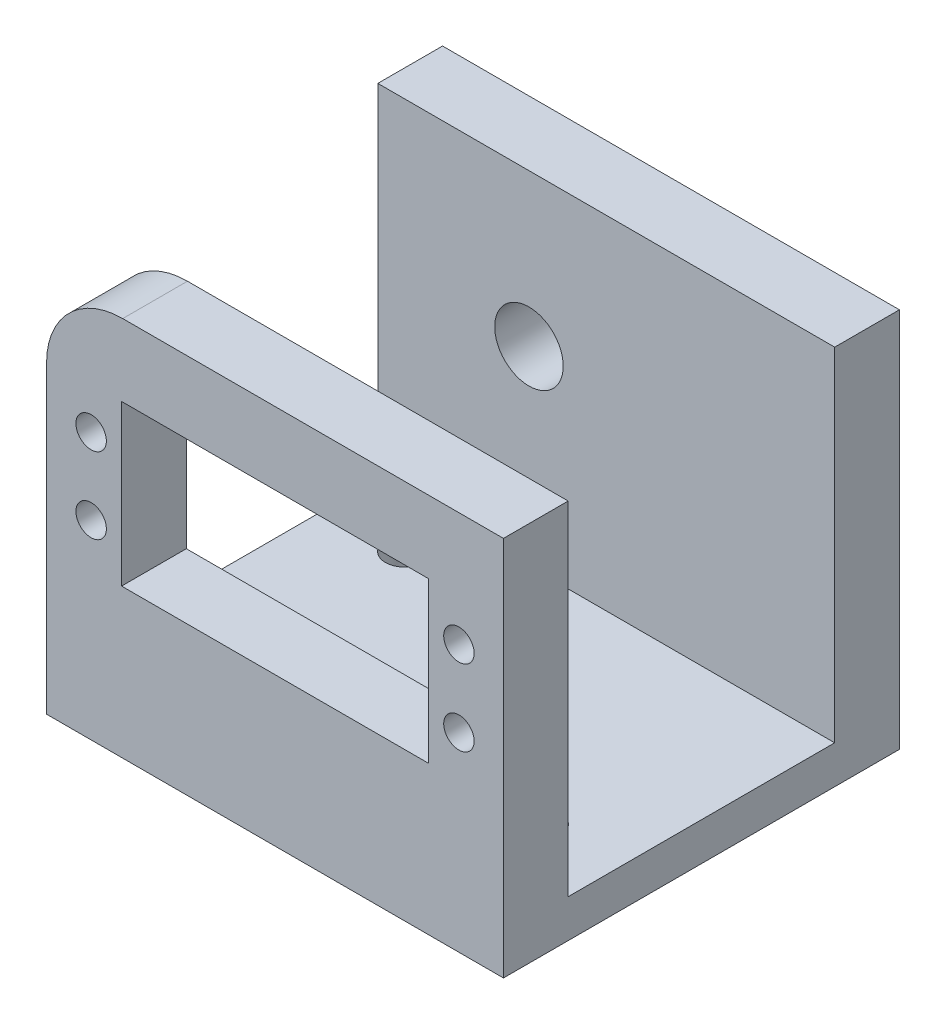
ISO-10303-21;
HEADER;
FILE_DESCRIPTION(('STEP AP214'),'2;1');
FILE_NAME('part.step','',(''),(''),'','','');
FILE_SCHEMA(('AUTOMOTIVE_DESIGN { 1 0 10303 214 1 1 1 1 }'));
ENDSEC;
DATA;
#1=APPLICATION_CONTEXT('core data for automotive mechanical design processes');
#2=APPLICATION_PROTOCOL_DEFINITION('international standard','automotive_design',2000,#1);
#3=PRODUCT_CONTEXT('',#1,'mechanical');
#4=PRODUCT('Part','Part','',(#3));
#5=PRODUCT_RELATED_PRODUCT_CATEGORY('part','',(#4));
#6=PRODUCT_DEFINITION_FORMATION('','',#4);
#7=PRODUCT_DEFINITION_CONTEXT('part definition',#1,'design');
#8=PRODUCT_DEFINITION('design','',#6,#7);
#9=PRODUCT_DEFINITION_SHAPE('','',#8);
#10=(LENGTH_UNIT() NAMED_UNIT(*) SI_UNIT(.MILLI.,.METRE.));
#11=(NAMED_UNIT(*) PLANE_ANGLE_UNIT() SI_UNIT($,.RADIAN.));
#12=(NAMED_UNIT(*) SI_UNIT($,.STERADIAN.) SOLID_ANGLE_UNIT());
#13=UNCERTAINTY_MEASURE_WITH_UNIT(LENGTH_MEASURE(1.E-05),#10,'distance_accuracy_value','');
#14=(GEOMETRIC_REPRESENTATION_CONTEXT(3) GLOBAL_UNCERTAINTY_ASSIGNED_CONTEXT((#13)) GLOBAL_UNIT_ASSIGNED_CONTEXT((#10,
#11,#12)) REPRESENTATION_CONTEXT('',''));
#15=CARTESIAN_POINT('',(0.,0.,0.));
#16=DIRECTION('',(0.,0.,1.));
#17=DIRECTION('',(1.,0.,0.));
#18=AXIS2_PLACEMENT_3D('',#15,#16,#17);
#19=CARTESIAN_POINT('',(-50.,40.,52.));
#20=DIRECTION('',(0.,0.,-1.));
#21=DIRECTION('',(-1.,0.,0.));
#22=AXIS2_PLACEMENT_3D('',#19,#20,#21);
#23=CYLINDRICAL_SURFACE('',#22,10.);
#24=DIRECTION('',(0.,0.,-1.));
#25=VECTOR('',#24,1.);
#26=CARTESIAN_POINT('',(-60.,40.,52.));
#27=LINE('',#26,#25);
#28=CARTESIAN_POINT('',(-60.,40.,52.));
#29=VERTEX_POINT('',#28);
#30=CARTESIAN_POINT('',(-60.,40.,43.5));
#31=VERTEX_POINT('',#30);
#32=EDGE_CURVE('E282',#29,#31,#27,.T.);
#33=ORIENTED_EDGE('',*,*,#32,.F.);
#34=CARTESIAN_POINT('',(-50.,40.,52.));
#35=DIRECTION('',(0.,0.,1.));
#36=DIRECTION('',(1.,0.,0.));
#37=AXIS2_PLACEMENT_3D('',#34,#35,#36);
#38=CIRCLE('',#37,10.);
#39=CARTESIAN_POINT('',(-50.,50.,52.));
#40=VERTEX_POINT('',#39);
#41=EDGE_CURVE('E11',#40,#29,#38,.T.);
#42=ORIENTED_EDGE('',*,*,#41,.F.);
#43=DIRECTION('',(0.,0.,-1.));
#44=VECTOR('',#43,1.);
#45=CARTESIAN_POINT('',(-50.,50.,52.));
#46=LINE('',#45,#44);
#47=CARTESIAN_POINT('',(-50.,50.,43.5));
#48=VERTEX_POINT('',#47);
#49=EDGE_CURVE('E47',#48,#40,#46,.F.);
#50=ORIENTED_EDGE('',*,*,#49,.F.);
#51=CARTESIAN_POINT('',(-50.,40.,43.5));
#52=DIRECTION('',(0.,0.,1.));
#53=DIRECTION('',(0.,-1.,0.));
#54=AXIS2_PLACEMENT_3D('',#51,#52,#53);
#55=CIRCLE('',#54,10.);
#56=EDGE_CURVE('E296',#31,#48,#55,.F.);
#57=ORIENTED_EDGE('',*,*,#56,.F.);
#58=EDGE_LOOP('',(#33,#42,#50,#57));
#59=FACE_BOUND('',#58,.T.);
#60=ADVANCED_FACE('F39',(#59),#23,.T.);
#61=CARTESIAN_POINT('',(0.,50.,52.));
#62=DIRECTION('',(0.,-1.,0.));
#63=DIRECTION('',(1.,0.,0.));
#64=AXIS2_PLACEMENT_3D('',#61,#62,#63);
#65=PLANE('',#64);
#66=DIRECTION('',(1.,0.,0.));
#67=VECTOR('',#66,1.);
#68=CARTESIAN_POINT('',(-60.,50.,43.5));
#69=LINE('',#68,#67);
#70=CARTESIAN_POINT('',(0.,50.,43.5));
#71=VERTEX_POINT('',#70);
#72=EDGE_CURVE('E209',#48,#71,#69,.T.);
#73=ORIENTED_EDGE('',*,*,#72,.F.);
#74=ORIENTED_EDGE('',*,*,#49,.T.);
#75=DIRECTION('',(-1.,0.,0.));
#76=VECTOR('',#75,1.);
#77=CARTESIAN_POINT('',(0.,50.,52.));
#78=LINE('',#77,#76);
#79=CARTESIAN_POINT('',(0.,50.,52.));
#80=VERTEX_POINT('',#79);
#81=EDGE_CURVE('E226',#80,#40,#78,.T.);
#82=ORIENTED_EDGE('',*,*,#81,.F.);
#83=DIRECTION('',(0.,0.,-1.));
#84=VECTOR('',#83,1.);
#85=CARTESIAN_POINT('',(0.,50.,52.));
#86=LINE('',#85,#84);
#87=EDGE_CURVE('E261',#80,#71,#86,.T.);
#88=ORIENTED_EDGE('',*,*,#87,.T.);
#89=EDGE_LOOP('',(#73,#74,#82,#88));
#90=FACE_BOUND('',#89,.T.);
#91=ADVANCED_FACE('F301',(#90),#65,.F.);
#92=CARTESIAN_POINT('',(0.,0.,52.));
#93=DIRECTION('',(-1.,0.,0.));
#94=DIRECTION('',(0.,-1.,0.));
#95=AXIS2_PLACEMENT_3D('',#92,#93,#94);
#96=PLANE('',#95);
#97=DIRECTION('',(0.,0.,-1.));
#98=VECTOR('',#97,1.);
#99=CARTESIAN_POINT('',(0.,5.,43.5));
#100=LINE('',#99,#98);
#101=CARTESIAN_POINT('',(0.,5.,43.5));
#102=VERTEX_POINT('',#101);
#103=CARTESIAN_POINT('',(0.,5.,8.49999999999999));
#104=VERTEX_POINT('',#103);
#105=EDGE_CURVE('E202',#102,#104,#100,.T.);
#106=ORIENTED_EDGE('',*,*,#105,.F.);
#107=DIRECTION('',(0.,-1.,0.));
#108=VECTOR('',#107,1.);
#109=CARTESIAN_POINT('',(0.,50.,43.5));
#110=LINE('',#109,#108);
#111=EDGE_CURVE('E198',#71,#102,#110,.T.);
#112=ORIENTED_EDGE('',*,*,#111,.F.);
#113=ORIENTED_EDGE('',*,*,#87,.F.);
#114=DIRECTION('',(0.,1.,0.));
#115=VECTOR('',#114,1.);
#116=CARTESIAN_POINT('',(0.,0.,52.));
#117=LINE('',#116,#115);
#118=CARTESIAN_POINT('',(0.,0.,52.));
#119=VERTEX_POINT('',#118);
#120=EDGE_CURVE('E222',#119,#80,#117,.T.);
#121=ORIENTED_EDGE('',*,*,#120,.F.);
#122=DIRECTION('',(0.,0.,-1.));
#123=VECTOR('',#122,1.);
#124=CARTESIAN_POINT('',(0.,0.,52.));
#125=LINE('',#124,#123);
#126=CARTESIAN_POINT('',(0.,0.,0.));
#127=VERTEX_POINT('',#126);
#128=EDGE_CURVE('E237',#119,#127,#125,.T.);
#129=ORIENTED_EDGE('',*,*,#128,.T.);
#130=DIRECTION('',(0.,1.,0.));
#131=VECTOR('',#130,1.);
#132=CARTESIAN_POINT('',(0.,0.,0.));
#133=LINE('',#132,#131);
#134=CARTESIAN_POINT('',(0.,50.,0.));
#135=VERTEX_POINT('',#134);
#136=EDGE_CURVE('E212',#127,#135,#133,.T.);
#137=ORIENTED_EDGE('',*,*,#136,.T.);
#138=CARTESIAN_POINT('',(0.,50.,8.5));
#139=VERTEX_POINT('',#138);
#140=EDGE_CURVE('E260',#139,#135,#86,.T.);
#141=ORIENTED_EDGE('',*,*,#140,.F.);
#142=DIRECTION('',(0.,1.,0.));
#143=VECTOR('',#142,1.);
#144=CARTESIAN_POINT('',(0.,50.,8.5));
#145=LINE('',#144,#143);
#146=EDGE_CURVE('E189',#104,#139,#145,.T.);
#147=ORIENTED_EDGE('',*,*,#146,.F.);
#148=EDGE_LOOP('',(#106,#112,#113,#121,#129,#137,#141,#147));
#149=FACE_BOUND('',#148,.T.);
#150=ADVANCED_FACE('F310',(#149),#96,.F.);
#151=DIRECTION('',(0.,0.,-1.));
#152=VECTOR('',#151,1.);
#153=CARTESIAN_POINT('',(-60.,50.,52.));
#154=LINE('',#153,#152);
#155=CARTESIAN_POINT('',(-60.,50.,8.5));
#156=VERTEX_POINT('',#155);
#157=CARTESIAN_POINT('',(-60.,50.,0.));
#158=VERTEX_POINT('',#157);
#159=EDGE_CURVE('E257',#156,#158,#154,.T.);
#160=ORIENTED_EDGE('',*,*,#159,.F.);
#161=DIRECTION('',(1.,0.,0.));
#162=VECTOR('',#161,1.);
#163=CARTESIAN_POINT('',(-60.,50.,8.5));
#164=LINE('',#163,#162);
#165=EDGE_CURVE('E213',#156,#139,#164,.T.);
#166=ORIENTED_EDGE('',*,*,#165,.T.);
#167=ORIENTED_EDGE('',*,*,#140,.T.);
#168=DIRECTION('',(-1.,0.,0.));
#169=VECTOR('',#168,1.);
#170=CARTESIAN_POINT('',(0.,50.,0.));
#171=LINE('',#170,#169);
#172=EDGE_CURVE('E241',#135,#158,#171,.T.);
#173=ORIENTED_EDGE('',*,*,#172,.T.);
#174=EDGE_LOOP('',(#160,#166,#167,#173));
#175=FACE_BOUND('',#174,.T.);
#176=ADVANCED_FACE('F332',(#175),#65,.F.);
#177=CARTESIAN_POINT('',(-60.,0.,52.));
#178=DIRECTION('',(1.,0.,0.));
#179=DIRECTION('',(0.,0.,-1.));
#180=AXIS2_PLACEMENT_3D('',#177,#178,#179);
#181=PLANE('',#180);
#182=DIRECTION('',(0.,-1.,0.));
#183=VECTOR('',#182,1.);
#184=CARTESIAN_POINT('',(-60.,0.,52.));
#185=LINE('',#184,#183);
#186=CARTESIAN_POINT('',(-60.,0.,52.));
#187=VERTEX_POINT('',#186);
#188=EDGE_CURVE('E231',#29,#187,#185,.T.);
#189=ORIENTED_EDGE('',*,*,#188,.F.);
#190=ORIENTED_EDGE('',*,*,#32,.T.);
#191=DIRECTION('',(0.,-1.,0.));
#192=VECTOR('',#191,1.);
#193=CARTESIAN_POINT('',(-60.,50.,43.5));
#194=LINE('',#193,#192);
#195=CARTESIAN_POINT('',(-60.,5.,43.5));
#196=VERTEX_POINT('',#195);
#197=EDGE_CURVE('E185',#31,#196,#194,.T.);
#198=ORIENTED_EDGE('',*,*,#197,.T.);
#199=DIRECTION('',(0.,0.,-1.));
#200=VECTOR('',#199,1.);
#201=CARTESIAN_POINT('',(-60.,5.,43.5));
#202=LINE('',#201,#200);
#203=CARTESIAN_POINT('',(-60.,5.,8.49999999999999));
#204=VERTEX_POINT('',#203);
#205=EDGE_CURVE('E188',#196,#204,#202,.T.);
#206=ORIENTED_EDGE('',*,*,#205,.T.);
#207=DIRECTION('',(0.,1.,0.));
#208=VECTOR('',#207,1.);
#209=CARTESIAN_POINT('',(-60.,50.,8.5));
#210=LINE('',#209,#208);
#211=EDGE_CURVE('E193',#204,#156,#210,.T.);
#212=ORIENTED_EDGE('',*,*,#211,.T.);
#213=ORIENTED_EDGE('',*,*,#159,.T.);
#214=DIRECTION('',(0.,-1.,0.));
#215=VECTOR('',#214,1.);
#216=CARTESIAN_POINT('',(-60.,0.,0.));
#217=LINE('',#216,#215);
#218=CARTESIAN_POINT('',(-60.,0.,0.));
#219=VERTEX_POINT('',#218);
#220=EDGE_CURVE('E245',#158,#219,#217,.T.);
#221=ORIENTED_EDGE('',*,*,#220,.T.);
#222=DIRECTION('',(0.,0.,-1.));
#223=VECTOR('',#222,1.);
#224=CARTESIAN_POINT('',(-60.,0.,52.));
#225=LINE('',#224,#223);
#226=EDGE_CURVE('E253',#187,#219,#225,.T.);
#227=ORIENTED_EDGE('',*,*,#226,.F.);
#228=EDGE_LOOP('',(#189,#190,#198,#206,#212,#213,#221,#227));
#229=FACE_BOUND('',#228,.T.);
#230=ADVANCED_FACE('F319',(#229),#181,.F.);
#231=CARTESIAN_POINT('',(0.,0.,52.));
#232=DIRECTION('',(0.,1.,0.));
#233=DIRECTION('',(-1.,0.,0.));
#234=AXIS2_PLACEMENT_3D('',#231,#232,#233);
#235=PLANE('',#234);
#236=CARTESIAN_POINT('',(-50.,0.,15.));
#237=DIRECTION('',(0.,1.,0.));
#238=DIRECTION('',(-1.,0.,0.));
#239=AXIS2_PLACEMENT_3D('',#236,#237,#238);
#240=CIRCLE('',#239,2.5);
#241=CARTESIAN_POINT('',(-52.5,0.,15.));
#242=VERTEX_POINT('',#241);
#243=EDGE_CURVE('E351',#242,#242,#240,.T.);
#244=ORIENTED_EDGE('',*,*,#243,.T.);
#245=EDGE_LOOP('',(#244));
#246=FACE_BOUND('',#245,.T.);
#247=CARTESIAN_POINT('',(-10.,0.,37.));
#248=DIRECTION('',(0.,1.,0.));
#249=DIRECTION('',(-1.,0.,0.));
#250=AXIS2_PLACEMENT_3D('',#247,#248,#249);
#251=CIRCLE('',#250,2.5);
#252=CARTESIAN_POINT('',(-12.5,0.,37.));
#253=VERTEX_POINT('',#252);
#254=EDGE_CURVE('E356',#253,#253,#251,.T.);
#255=ORIENTED_EDGE('',*,*,#254,.T.);
#256=EDGE_LOOP('',(#255));
#257=FACE_BOUND('',#256,.T.);
#258=DIRECTION('',(1.,0.,0.));
#259=VECTOR('',#258,1.);
#260=CARTESIAN_POINT('',(0.,0.,0.));
#261=LINE('',#260,#259);
#262=EDGE_CURVE('E227',#219,#127,#261,.T.);
#263=ORIENTED_EDGE('',*,*,#262,.T.);
#264=ORIENTED_EDGE('',*,*,#128,.F.);
#265=DIRECTION('',(1.,0.,0.));
#266=VECTOR('',#265,1.);
#267=CARTESIAN_POINT('',(0.,0.,52.));
#268=LINE('',#267,#266);
#269=EDGE_CURVE('E234',#187,#119,#268,.T.);
#270=ORIENTED_EDGE('',*,*,#269,.F.);
#271=ORIENTED_EDGE('',*,*,#226,.T.);
#272=EDGE_LOOP('',(#263,#264,#270,#271));
#273=FACE_BOUND('',#272,.T.);
#274=ADVANCED_FACE('F324',(#246,#257,#273),#235,.F.);
#275=CARTESIAN_POINT('',(0.,0.,52.));
#276=DIRECTION('',(0.,0.,1.));
#277=DIRECTION('',(1.,0.,0.));
#278=AXIS2_PLACEMENT_3D('',#275,#276,#277);
#279=PLANE('',#278);
#280=CARTESIAN_POINT('',(-5.85000000000008,34.9999999999988,52.));
#281=DIRECTION('',(0.,0.,1.));
#282=DIRECTION('',(1.,0.,0.));
#283=AXIS2_PLACEMENT_3D('',#280,#281,#282);
#284=CIRCLE('',#283,2.00000000000062);
#285=CARTESIAN_POINT('',(-3.84999999999945,34.9999999999988,52.));
#286=VERTEX_POINT('',#285);
#287=EDGE_CURVE('E172',#286,#286,#284,.T.);
#288=ORIENTED_EDGE('',*,*,#287,.F.);
#289=EDGE_LOOP('',(#288));
#290=FACE_BOUND('',#289,.T.);
#291=CARTESIAN_POINT('',(-54.1500000000001,24.9999999999976,52.));
#292=DIRECTION('',(0.,0.,1.));
#293=DIRECTION('',(1.,0.,0.));
#294=AXIS2_PLACEMENT_3D('',#291,#292,#293);
#295=CIRCLE('',#294,2.00000000000085);
#296=CARTESIAN_POINT('',(-52.1499999999992,24.9999999999976,52.));
#297=VERTEX_POINT('',#296);
#298=EDGE_CURVE('E177',#297,#297,#295,.T.);
#299=ORIENTED_EDGE('',*,*,#298,.F.);
#300=EDGE_LOOP('',(#299));
#301=FACE_BOUND('',#300,.T.);
#302=CARTESIAN_POINT('',(-5.85000000000008,24.9999999999976,52.));
#303=DIRECTION('',(0.,0.,1.));
#304=DIRECTION('',(1.,0.,0.));
#305=AXIS2_PLACEMENT_3D('',#302,#303,#304);
#306=CIRCLE('',#305,2.00000000000085);
#307=CARTESIAN_POINT('',(-3.84999999999922,24.9999999999976,52.));
#308=VERTEX_POINT('',#307);
#309=EDGE_CURVE('E167',#308,#308,#306,.T.);
#310=ORIENTED_EDGE('',*,*,#309,.F.);
#311=EDGE_LOOP('',(#310));
#312=FACE_BOUND('',#311,.T.);
#313=DIRECTION('',(0.,-1.,0.));
#314=VECTOR('',#313,1.);
#315=CARTESIAN_POINT('',(-50.1500000000001,40.5,52.));
#316=LINE('',#315,#314);
#317=CARTESIAN_POINT('',(-50.1500000000001,40.5,52.));
#318=VERTEX_POINT('',#317);
#319=CARTESIAN_POINT('',(-50.1500000000001,19.5,52.));
#320=VERTEX_POINT('',#319);
#321=EDGE_CURVE('E152',#318,#320,#316,.T.);
#322=ORIENTED_EDGE('',*,*,#321,.F.);
#323=DIRECTION('',(-1.,0.,0.));
#324=VECTOR('',#323,1.);
#325=CARTESIAN_POINT('',(-50.1500000000001,40.5,52.));
#326=LINE('',#325,#324);
#327=CARTESIAN_POINT('',(-9.85000000000008,40.5,52.));
#328=VERTEX_POINT('',#327);
#329=EDGE_CURVE('E157',#328,#318,#326,.T.);
#330=ORIENTED_EDGE('',*,*,#329,.F.);
#331=DIRECTION('',(0.,1.,0.));
#332=VECTOR('',#331,1.);
#333=CARTESIAN_POINT('',(-9.85000000000008,40.5,52.));
#334=LINE('',#333,#332);
#335=CARTESIAN_POINT('',(-9.85000000000008,19.5,52.));
#336=VERTEX_POINT('',#335);
#337=EDGE_CURVE('E134',#336,#328,#334,.T.);
#338=ORIENTED_EDGE('',*,*,#337,.F.);
#339=DIRECTION('',(1.,0.,0.));
#340=VECTOR('',#339,1.);
#341=CARTESIAN_POINT('',(-50.1500000000001,19.5,52.));
#342=LINE('',#341,#340);
#343=EDGE_CURVE('E146',#320,#336,#342,.T.);
#344=ORIENTED_EDGE('',*,*,#343,.F.);
#345=EDGE_LOOP('',(#322,#330,#338,#344));
#346=FACE_BOUND('',#345,.T.);
#347=CARTESIAN_POINT('',(-54.1500000000001,34.9999999999988,52.));
#348=DIRECTION('',(0.,0.,1.));
#349=DIRECTION('',(1.,0.,0.));
#350=AXIS2_PLACEMENT_3D('',#347,#348,#349);
#351=CIRCLE('',#350,2.00000000000001);
#352=CARTESIAN_POINT('',(-52.15,34.9999999999988,52.));
#353=VERTEX_POINT('',#352);
#354=EDGE_CURVE('E176',#353,#353,#351,.T.);
#355=ORIENTED_EDGE('',*,*,#354,.F.);
#356=EDGE_LOOP('',(#355));
#357=FACE_BOUND('',#356,.T.);
#358=ORIENTED_EDGE('',*,*,#81,.T.);
#359=ORIENTED_EDGE('',*,*,#41,.T.);
#360=ORIENTED_EDGE('',*,*,#188,.T.);
#361=ORIENTED_EDGE('',*,*,#269,.T.);
#362=ORIENTED_EDGE('',*,*,#120,.T.);
#363=EDGE_LOOP('',(#358,#359,#360,#361,#362));
#364=FACE_BOUND('',#363,.T.);
#365=ADVANCED_FACE('F154',(#290,#301,#312,#346,#357,#364),#279,.T.);
#366=CARTESIAN_POINT('',(0.,0.,0.));
#367=DIRECTION('',(0.,0.,1.));
#368=DIRECTION('',(1.,0.,0.));
#369=AXIS2_PLACEMENT_3D('',#366,#367,#368);
#370=PLANE('',#369);
#371=CARTESIAN_POINT('',(-40.15,30.,0.));
#372=DIRECTION('',(0.,0.,1.));
#373=DIRECTION('',(1.,0.,0.));
#374=AXIS2_PLACEMENT_3D('',#371,#372,#373);
#375=CIRCLE('',#374,4.5);
#376=CARTESIAN_POINT('',(-35.65,30.,0.));
#377=VERTEX_POINT('',#376);
#378=EDGE_CURVE('E340',#377,#377,#375,.T.);
#379=ORIENTED_EDGE('',*,*,#378,.T.);
#380=EDGE_LOOP('',(#379));
#381=FACE_BOUND('',#380,.T.);
#382=ORIENTED_EDGE('',*,*,#136,.F.);
#383=ORIENTED_EDGE('',*,*,#262,.F.);
#384=ORIENTED_EDGE('',*,*,#220,.F.);
#385=ORIENTED_EDGE('',*,*,#172,.F.);
#386=EDGE_LOOP('',(#382,#383,#384,#385));
#387=FACE_BOUND('',#386,.T.);
#388=ADVANCED_FACE('F329',(#381,#387),#370,.F.);
#389=CARTESIAN_POINT('',(-60.,50.,43.5));
#390=DIRECTION('',(0.,0.,1.));
#391=DIRECTION('',(0.,-1.,0.));
#392=AXIS2_PLACEMENT_3D('',#389,#390,#391);
#393=PLANE('',#392);
#394=CARTESIAN_POINT('',(-5.85000000000008,34.9999999999988,43.5));
#395=DIRECTION('',(0.,0.,1.));
#396=DIRECTION('',(0.,-1.,0.));
#397=AXIS2_PLACEMENT_3D('',#394,#395,#396);
#398=CIRCLE('',#397,2.00000000000062);
#399=CARTESIAN_POINT('',(-5.85000000000008,32.9999999999982,43.5));
#400=VERTEX_POINT('',#399);
#401=EDGE_CURVE('E203',#400,#400,#398,.T.);
#402=ORIENTED_EDGE('',*,*,#401,.T.);
#403=EDGE_LOOP('',(#402));
#404=FACE_BOUND('',#403,.T.);
#405=CARTESIAN_POINT('',(-54.1500000000001,24.9999999999976,43.5));
#406=DIRECTION('',(0.,0.,1.));
#407=DIRECTION('',(0.,-1.,0.));
#408=AXIS2_PLACEMENT_3D('',#405,#406,#407);
#409=CIRCLE('',#408,2.00000000000085);
#410=CARTESIAN_POINT('',(-54.1500000000001,22.9999999999968,43.5));
#411=VERTEX_POINT('',#410);
#412=EDGE_CURVE('E286',#411,#411,#409,.T.);
#413=ORIENTED_EDGE('',*,*,#412,.T.);
#414=EDGE_LOOP('',(#413));
#415=FACE_BOUND('',#414,.T.);
#416=CARTESIAN_POINT('',(-5.85000000000008,24.9999999999976,43.5));
#417=DIRECTION('',(0.,0.,1.));
#418=DIRECTION('',(0.,-1.,0.));
#419=AXIS2_PLACEMENT_3D('',#416,#417,#418);
#420=CIRCLE('',#419,2.00000000000085);
#421=CARTESIAN_POINT('',(-5.85000000000008,22.9999999999968,43.5));
#422=VERTEX_POINT('',#421);
#423=EDGE_CURVE('E269',#422,#422,#420,.T.);
#424=ORIENTED_EDGE('',*,*,#423,.T.);
#425=EDGE_LOOP('',(#424));
#426=FACE_BOUND('',#425,.T.);
#427=DIRECTION('',(-1.,0.,0.));
#428=VECTOR('',#427,1.);
#429=CARTESIAN_POINT('',(-60.,40.5,43.5));
#430=LINE('',#429,#428);
#431=CARTESIAN_POINT('',(-9.85000000000008,40.5,43.5));
#432=VERTEX_POINT('',#431);
#433=CARTESIAN_POINT('',(-50.1500000000001,40.5,43.5));
#434=VERTEX_POINT('',#433);
#435=EDGE_CURVE('E274',#432,#434,#430,.T.);
#436=ORIENTED_EDGE('',*,*,#435,.T.);
#437=DIRECTION('',(0.,-1.,0.));
#438=VECTOR('',#437,1.);
#439=CARTESIAN_POINT('',(-50.1500000000001,50.,43.5));
#440=LINE('',#439,#438);
#441=CARTESIAN_POINT('',(-50.1500000000001,19.5,43.5));
#442=VERTEX_POINT('',#441);
#443=EDGE_CURVE('E278',#434,#442,#440,.T.);
#444=ORIENTED_EDGE('',*,*,#443,.T.);
#445=DIRECTION('',(1.,0.,0.));
#446=VECTOR('',#445,1.);
#447=CARTESIAN_POINT('',(-60.,19.5,43.5));
#448=LINE('',#447,#446);
#449=CARTESIAN_POINT('',(-9.85000000000008,19.5,43.5));
#450=VERTEX_POINT('',#449);
#451=EDGE_CURVE('E265',#442,#450,#448,.T.);
#452=ORIENTED_EDGE('',*,*,#451,.T.);
#453=DIRECTION('',(0.,1.,0.));
#454=VECTOR('',#453,1.);
#455=CARTESIAN_POINT('',(-9.85000000000007,50.,43.5));
#456=LINE('',#455,#454);
#457=EDGE_CURVE('E137',#450,#432,#456,.T.);
#458=ORIENTED_EDGE('',*,*,#457,.T.);
#459=EDGE_LOOP('',(#436,#444,#452,#458));
#460=FACE_BOUND('',#459,.T.);
#461=CARTESIAN_POINT('',(-54.1500000000001,34.9999999999988,43.5));
#462=DIRECTION('',(0.,0.,1.));
#463=DIRECTION('',(0.,-1.,0.));
#464=AXIS2_PLACEMENT_3D('',#461,#462,#463);
#465=CIRCLE('',#464,2.00000000000001);
#466=CARTESIAN_POINT('',(-54.1500000000001,32.9999999999988,43.5));
#467=VERTEX_POINT('',#466);
#468=EDGE_CURVE('E184',#467,#467,#465,.T.);
#469=ORIENTED_EDGE('',*,*,#468,.T.);
#470=EDGE_LOOP('',(#469));
#471=FACE_BOUND('',#470,.T.);
#472=ORIENTED_EDGE('',*,*,#197,.F.);
#473=ORIENTED_EDGE('',*,*,#56,.T.);
#474=ORIENTED_EDGE('',*,*,#72,.T.);
#475=ORIENTED_EDGE('',*,*,#111,.T.);
#476=DIRECTION('',(1.,0.,0.));
#477=VECTOR('',#476,1.);
#478=CARTESIAN_POINT('',(-60.,5.,43.5));
#479=LINE('',#478,#477);
#480=EDGE_CURVE('E197',#196,#102,#479,.T.);
#481=ORIENTED_EDGE('',*,*,#480,.F.);
#482=EDGE_LOOP('',(#472,#473,#474,#475,#481));
#483=FACE_BOUND('',#482,.T.);
#484=ADVANCED_FACE('F315',(#404,#415,#426,#460,#471,#483),#393,.F.);
#485=CARTESIAN_POINT('',(-60.,50.,8.5));
#486=DIRECTION('',(0.,0.,-1.));
#487=DIRECTION('',(0.,1.,0.));
#488=AXIS2_PLACEMENT_3D('',#485,#486,#487);
#489=PLANE('',#488);
#490=CARTESIAN_POINT('',(-40.15,30.,8.49999999999999));
#491=DIRECTION('',(0.,0.,1.));
#492=DIRECTION('',(1.,0.,0.));
#493=AXIS2_PLACEMENT_3D('',#490,#491,#492);
#494=CIRCLE('',#493,4.5);
#495=CARTESIAN_POINT('',(-35.65,30.,8.49999999999999));
#496=VERTEX_POINT('',#495);
#497=EDGE_CURVE('E346',#496,#496,#494,.T.);
#498=ORIENTED_EDGE('',*,*,#497,.F.);
#499=EDGE_LOOP('',(#498));
#500=FACE_BOUND('',#499,.T.);
#501=ORIENTED_EDGE('',*,*,#146,.T.);
#502=ORIENTED_EDGE('',*,*,#165,.F.);
#503=ORIENTED_EDGE('',*,*,#211,.F.);
#504=DIRECTION('',(1.,0.,0.));
#505=VECTOR('',#504,1.);
#506=CARTESIAN_POINT('',(-60.,5.,8.49999999999999));
#507=LINE('',#506,#505);
#508=EDGE_CURVE('E217',#204,#104,#507,.T.);
#509=ORIENTED_EDGE('',*,*,#508,.T.);
#510=EDGE_LOOP('',(#501,#502,#503,#509));
#511=FACE_BOUND('',#510,.T.);
#512=ADVANCED_FACE('F378',(#500,#511),#489,.F.);
#513=CARTESIAN_POINT('',(-60.,5.,43.5));
#514=DIRECTION('',(0.,-1.,0.));
#515=DIRECTION('',(0.,0.,-1.));
#516=AXIS2_PLACEMENT_3D('',#513,#514,#515);
#517=PLANE('',#516);
#518=CARTESIAN_POINT('',(-50.,5.,15.));
#519=DIRECTION('',(0.,1.,0.));
#520=DIRECTION('',(0.,0.,1.));
#521=AXIS2_PLACEMENT_3D('',#518,#519,#520);
#522=CIRCLE('',#521,2.5);
#523=CARTESIAN_POINT('',(-50.,5.,17.5));
#524=VERTEX_POINT('',#523);
#525=EDGE_CURVE('E362',#524,#524,#522,.T.);
#526=ORIENTED_EDGE('',*,*,#525,.F.);
#527=EDGE_LOOP('',(#526));
#528=FACE_BOUND('',#527,.T.);
#529=CARTESIAN_POINT('',(-10.,5.,37.));
#530=DIRECTION('',(0.,1.,0.));
#531=DIRECTION('',(0.,0.,1.));
#532=AXIS2_PLACEMENT_3D('',#529,#530,#531);
#533=CIRCLE('',#532,2.5);
#534=CARTESIAN_POINT('',(-10.,5.,39.5));
#535=VERTEX_POINT('',#534);
#536=EDGE_CURVE('E363',#535,#535,#533,.T.);
#537=ORIENTED_EDGE('',*,*,#536,.F.);
#538=EDGE_LOOP('',(#537));
#539=FACE_BOUND('',#538,.T.);
#540=ORIENTED_EDGE('',*,*,#105,.T.);
#541=ORIENTED_EDGE('',*,*,#508,.F.);
#542=ORIENTED_EDGE('',*,*,#205,.F.);
#543=ORIENTED_EDGE('',*,*,#480,.T.);
#544=EDGE_LOOP('',(#540,#541,#542,#543));
#545=FACE_BOUND('',#544,.T.);
#546=ADVANCED_FACE('F374',(#528,#539,#545),#517,.F.);
#547=CARTESIAN_POINT('',(-54.1500000000001,34.9999999999988,42.));
#548=DIRECTION('',(0.,0.,1.));
#549=DIRECTION('',(1.,0.,0.));
#550=AXIS2_PLACEMENT_3D('',#547,#548,#549);
#551=CYLINDRICAL_SURFACE('',#550,2.00000000000001);
#552=ORIENTED_EDGE('',*,*,#354,.T.);
#553=EDGE_LOOP('',(#552));
#554=FACE_BOUND('',#553,.T.);
#555=ORIENTED_EDGE('',*,*,#468,.F.);
#556=EDGE_LOOP('',(#555));
#557=FACE_BOUND('',#556,.T.);
#558=ADVANCED_FACE('F377',(#554,#557),#551,.F.);
#559=CARTESIAN_POINT('',(-50.1500000000001,40.5,42.));
#560=DIRECTION('',(-1.,0.,0.));
#561=DIRECTION('',(0.,0.,1.));
#562=AXIS2_PLACEMENT_3D('',#559,#560,#561);
#563=PLANE('',#562);
#564=DIRECTION('',(0.,0.,1.));
#565=VECTOR('',#564,1.);
#566=CARTESIAN_POINT('',(-50.1500000000001,40.5,42.));
#567=LINE('',#566,#565);
#568=EDGE_CURVE('E164',#434,#318,#567,.T.);
#569=ORIENTED_EDGE('',*,*,#568,.T.);
#570=ORIENTED_EDGE('',*,*,#321,.T.);
#571=DIRECTION('',(0.,0.,1.));
#572=VECTOR('',#571,1.);
#573=CARTESIAN_POINT('',(-50.1500000000001,19.5,42.));
#574=LINE('',#573,#572);
#575=EDGE_CURVE('E142',#442,#320,#574,.T.);
#576=ORIENTED_EDGE('',*,*,#575,.F.);
#577=ORIENTED_EDGE('',*,*,#443,.F.);
#578=EDGE_LOOP('',(#569,#570,#576,#577));
#579=FACE_BOUND('',#578,.T.);
#580=ADVANCED_FACE('F438',(#579),#563,.F.);
#581=CARTESIAN_POINT('',(-50.1500000000001,40.5,42.));
#582=DIRECTION('',(0.,1.,0.));
#583=DIRECTION('',(0.,0.,1.));
#584=AXIS2_PLACEMENT_3D('',#581,#582,#583);
#585=PLANE('',#584);
#586=DIRECTION('',(0.,0.,1.));
#587=VECTOR('',#586,1.);
#588=CARTESIAN_POINT('',(-9.85000000000008,40.5,42.));
#589=LINE('',#588,#587);
#590=EDGE_CURVE('E141',#432,#328,#589,.T.);
#591=ORIENTED_EDGE('',*,*,#590,.T.);
#592=ORIENTED_EDGE('',*,*,#329,.T.);
#593=ORIENTED_EDGE('',*,*,#568,.F.);
#594=ORIENTED_EDGE('',*,*,#435,.F.);
#595=EDGE_LOOP('',(#591,#592,#593,#594));
#596=FACE_BOUND('',#595,.T.);
#597=ADVANCED_FACE('F443',(#596),#585,.F.);
#598=CARTESIAN_POINT('',(-9.85000000000008,40.5,42.));
#599=DIRECTION('',(1.,0.,0.));
#600=DIRECTION('',(0.,0.,-1.));
#601=AXIS2_PLACEMENT_3D('',#598,#599,#600);
#602=PLANE('',#601);
#603=DIRECTION('',(0.,0.,1.));
#604=VECTOR('',#603,1.);
#605=CARTESIAN_POINT('',(-9.85000000000008,19.5,42.));
#606=LINE('',#605,#604);
#607=EDGE_CURVE('E129',#450,#336,#606,.T.);
#608=ORIENTED_EDGE('',*,*,#607,.T.);
#609=ORIENTED_EDGE('',*,*,#337,.T.);
#610=ORIENTED_EDGE('',*,*,#590,.F.);
#611=ORIENTED_EDGE('',*,*,#457,.F.);
#612=EDGE_LOOP('',(#608,#609,#610,#611));
#613=FACE_BOUND('',#612,.T.);
#614=ADVANCED_FACE('F131',(#613),#602,.F.);
#615=CARTESIAN_POINT('',(-50.1500000000001,19.5,42.));
#616=DIRECTION('',(0.,-1.,0.));
#617=DIRECTION('',(0.,0.,-1.));
#618=AXIS2_PLACEMENT_3D('',#615,#616,#617);
#619=PLANE('',#618);
#620=ORIENTED_EDGE('',*,*,#575,.T.);
#621=ORIENTED_EDGE('',*,*,#343,.T.);
#622=ORIENTED_EDGE('',*,*,#607,.F.);
#623=ORIENTED_EDGE('',*,*,#451,.F.);
#624=EDGE_LOOP('',(#620,#621,#622,#623));
#625=FACE_BOUND('',#624,.T.);
#626=ADVANCED_FACE('F147',(#625),#619,.F.);
#627=CARTESIAN_POINT('',(-5.85000000000008,24.9999999999976,42.));
#628=DIRECTION('',(0.,0.,1.));
#629=DIRECTION('',(1.,0.,0.));
#630=AXIS2_PLACEMENT_3D('',#627,#628,#629);
#631=CYLINDRICAL_SURFACE('',#630,2.00000000000085);
#632=ORIENTED_EDGE('',*,*,#309,.T.);
#633=EDGE_LOOP('',(#632));
#634=FACE_BOUND('',#633,.T.);
#635=ORIENTED_EDGE('',*,*,#423,.F.);
#636=EDGE_LOOP('',(#635));
#637=FACE_BOUND('',#636,.T.);
#638=ADVANCED_FACE('F427',(#634,#637),#631,.F.);
#639=CARTESIAN_POINT('',(-54.1500000000001,24.9999999999976,42.));
#640=DIRECTION('',(0.,0.,1.));
#641=DIRECTION('',(1.,0.,0.));
#642=AXIS2_PLACEMENT_3D('',#639,#640,#641);
#643=CYLINDRICAL_SURFACE('',#642,2.00000000000085);
#644=ORIENTED_EDGE('',*,*,#298,.T.);
#645=EDGE_LOOP('',(#644));
#646=FACE_BOUND('',#645,.T.);
#647=ORIENTED_EDGE('',*,*,#412,.F.);
#648=EDGE_LOOP('',(#647));
#649=FACE_BOUND('',#648,.T.);
#650=ADVANCED_FACE('F423',(#646,#649),#643,.F.);
#651=CARTESIAN_POINT('',(-5.85000000000008,34.9999999999988,42.));
#652=DIRECTION('',(0.,0.,1.));
#653=DIRECTION('',(1.,0.,0.));
#654=AXIS2_PLACEMENT_3D('',#651,#652,#653);
#655=CYLINDRICAL_SURFACE('',#654,2.00000000000062);
#656=ORIENTED_EDGE('',*,*,#287,.T.);
#657=EDGE_LOOP('',(#656));
#658=FACE_BOUND('',#657,.T.);
#659=ORIENTED_EDGE('',*,*,#401,.F.);
#660=EDGE_LOOP('',(#659));
#661=FACE_BOUND('',#660,.T.);
#662=ADVANCED_FACE('F426',(#658,#661),#655,.F.);
#663=CARTESIAN_POINT('',(-40.15,30.,-1.50000000000001));
#664=DIRECTION('',(0.,0.,1.));
#665=DIRECTION('',(1.,0.,0.));
#666=AXIS2_PLACEMENT_3D('',#663,#664,#665);
#667=CYLINDRICAL_SURFACE('',#666,4.5);
#668=ORIENTED_EDGE('',*,*,#497,.T.);
#669=EDGE_LOOP('',(#668));
#670=FACE_BOUND('',#669,.T.);
#671=ORIENTED_EDGE('',*,*,#378,.F.);
#672=EDGE_LOOP('',(#671));
#673=FACE_BOUND('',#672,.T.);
#674=ADVANCED_FACE('F447',(#670,#673),#667,.F.);
#675=CARTESIAN_POINT('',(-10.,-5.,37.));
#676=DIRECTION('',(0.,1.,0.));
#677=DIRECTION('',(0.,0.,1.));
#678=AXIS2_PLACEMENT_3D('',#675,#676,#677);
#679=CYLINDRICAL_SURFACE('',#678,2.5);
#680=ORIENTED_EDGE('',*,*,#536,.T.);
#681=EDGE_LOOP('',(#680));
#682=FACE_BOUND('',#681,.T.);
#683=ORIENTED_EDGE('',*,*,#254,.F.);
#684=EDGE_LOOP('',(#683));
#685=FACE_BOUND('',#684,.T.);
#686=ADVANCED_FACE('F461',(#682,#685),#679,.F.);
#687=CARTESIAN_POINT('',(-50.,-5.,15.));
#688=DIRECTION('',(0.,1.,0.));
#689=DIRECTION('',(0.,0.,1.));
#690=AXIS2_PLACEMENT_3D('',#687,#688,#689);
#691=CYLINDRICAL_SURFACE('',#690,2.5);
#692=ORIENTED_EDGE('',*,*,#525,.T.);
#693=EDGE_LOOP('',(#692));
#694=FACE_BOUND('',#693,.T.);
#695=ORIENTED_EDGE('',*,*,#243,.F.);
#696=EDGE_LOOP('',(#695));
#697=FACE_BOUND('',#696,.T.);
#698=ADVANCED_FACE('F371',(#694,#697),#691,.F.);
#699=CLOSED_SHELL('',(#60,#91,#150,#176,#230,#274,#365,#388,#484,#512,#546,#558,#580,#597,#614,
#626,#638,#650,#662,#674,#686,#698));
#700=MANIFOLD_SOLID_BREP('B2',#699);
#701=ADVANCED_BREP_SHAPE_REPRESENTATION('',(#18,#700),#14);
#702=SHAPE_DEFINITION_REPRESENTATION(#9,#701);
ENDSEC;
END-ISO-10303-21;
